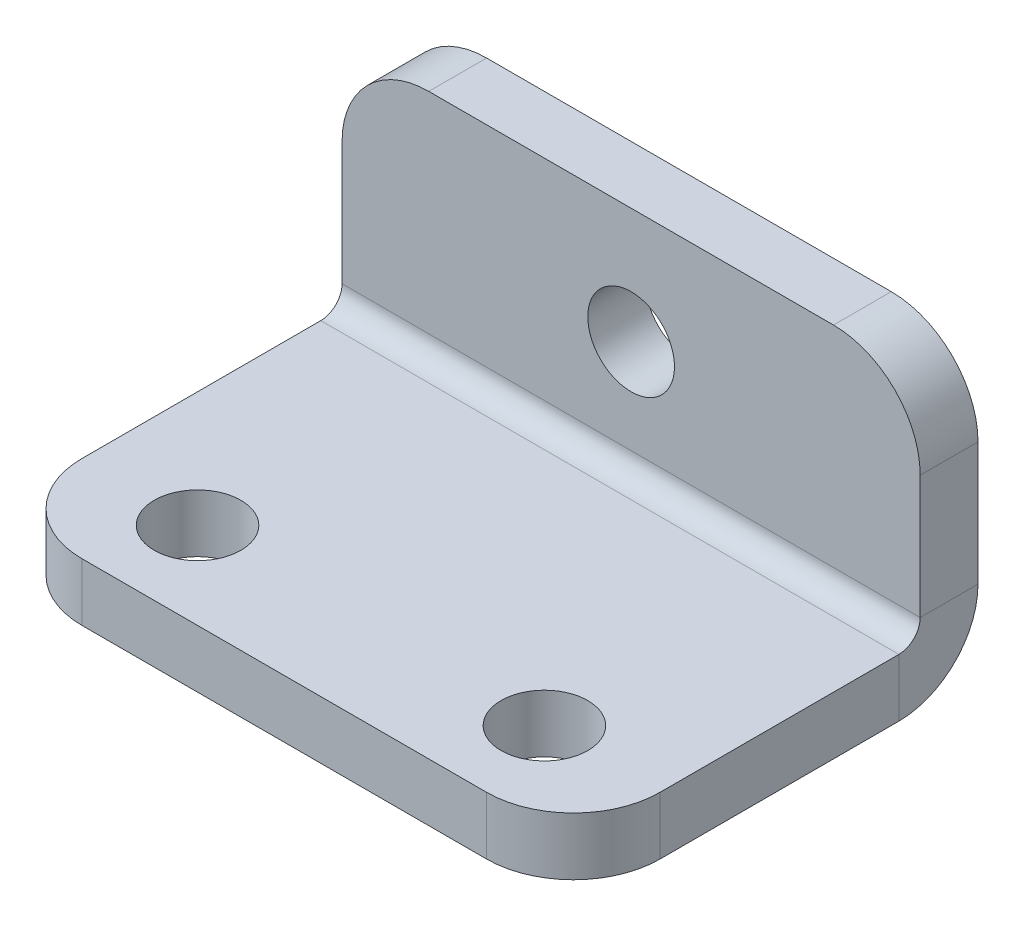
ISO-10303-21;
HEADER;
FILE_DESCRIPTION(('STEP AP214'),'2;1');
FILE_NAME('part.step','',(''),(''),'','','');
FILE_SCHEMA(('AUTOMOTIVE_DESIGN { 1 0 10303 214 1 1 1 1 }'));
ENDSEC;
DATA;
#1=APPLICATION_CONTEXT('core data for automotive mechanical design processes');
#2=APPLICATION_PROTOCOL_DEFINITION('international standard','automotive_design',2000,#1);
#3=PRODUCT_CONTEXT('',#1,'mechanical');
#4=PRODUCT('Part','Part','',(#3));
#5=PRODUCT_RELATED_PRODUCT_CATEGORY('part','',(#4));
#6=PRODUCT_DEFINITION_FORMATION('','',#4);
#7=PRODUCT_DEFINITION_CONTEXT('part definition',#1,'design');
#8=PRODUCT_DEFINITION('design','',#6,#7);
#9=PRODUCT_DEFINITION_SHAPE('','',#8);
#10=(LENGTH_UNIT() NAMED_UNIT(*) SI_UNIT(.MILLI.,.METRE.));
#11=(NAMED_UNIT(*) PLANE_ANGLE_UNIT() SI_UNIT($,.RADIAN.));
#12=(NAMED_UNIT(*) SI_UNIT($,.STERADIAN.) SOLID_ANGLE_UNIT());
#13=UNCERTAINTY_MEASURE_WITH_UNIT(LENGTH_MEASURE(1.E-05),#10,'distance_accuracy_value','');
#14=(GEOMETRIC_REPRESENTATION_CONTEXT(3) GLOBAL_UNCERTAINTY_ASSIGNED_CONTEXT((#13)) GLOBAL_UNIT_ASSIGNED_CONTEXT((#10,
#11,#12)) REPRESENTATION_CONTEXT('',''));
#15=CARTESIAN_POINT('',(0.,0.,0.));
#16=DIRECTION('',(0.,0.,1.));
#17=DIRECTION('',(1.,0.,0.));
#18=AXIS2_PLACEMENT_3D('',#15,#16,#17);
#19=CARTESIAN_POINT('',(10.,0.7366,-12.));
#20=DIRECTION('',(1.,0.,0.));
#21=DIRECTION('',(0.,0.,-1.));
#22=AXIS2_PLACEMENT_3D('',#19,#20,#21);
#23=PLANE('',#22);
#24=DIRECTION('',(0.,0.,-1.));
#25=VECTOR('',#24,1.);
#26=CARTESIAN_POINT('',(10.,0.7366,-12.));
#27=LINE('',#26,#25);
#28=CARTESIAN_POINT('',(10.,0.7366,-12.));
#29=VERTEX_POINT('',#28);
#30=CARTESIAN_POINT('',(10.,0.7366,-14.));
#31=VERTEX_POINT('',#30);
#32=EDGE_CURVE('E126',#29,#31,#27,.T.);
#33=ORIENTED_EDGE('',*,*,#32,.F.);
#34=CARTESIAN_POINT('',(10.,0.7366,-11.2634));
#35=DIRECTION('',(-1.,0.,0.));
#36=DIRECTION('',(0.,0.,1.));
#37=AXIS2_PLACEMENT_3D('',#34,#35,#36);
#38=CIRCLE('',#37,0.7366);
#39=CARTESIAN_POINT('',(10.,0.,-11.2634));
#40=VERTEX_POINT('',#39);
#41=EDGE_CURVE('E130',#40,#29,#38,.F.);
#42=ORIENTED_EDGE('',*,*,#41,.F.);
#43=DIRECTION('',(0.,1.,0.));
#44=VECTOR('',#43,1.);
#45=CARTESIAN_POINT('',(10.,-2.,-11.2634));
#46=LINE('',#45,#44);
#47=CARTESIAN_POINT('',(10.,-2.,-11.2634));
#48=VERTEX_POINT('',#47);
#49=EDGE_CURVE('E138',#48,#40,#46,.T.);
#50=ORIENTED_EDGE('',*,*,#49,.F.);
#51=CARTESIAN_POINT('',(10.,0.7366,-11.2634));
#52=DIRECTION('',(1.,0.,0.));
#53=DIRECTION('',(0.,0.,-1.));
#54=AXIS2_PLACEMENT_3D('',#51,#52,#53);
#55=CIRCLE('',#54,2.7366);
#56=EDGE_CURVE('E132',#48,#31,#55,.T.);
#57=ORIENTED_EDGE('',*,*,#56,.T.);
#58=EDGE_LOOP('',(#33,#42,#50,#57));
#59=FACE_BOUND('',#58,.T.);
#60=ADVANCED_FACE('F34',(#59),#23,.T.);
#61=CARTESIAN_POINT('',(10.,-2.,-11.2634));
#62=DIRECTION('',(1.,0.,0.));
#63=DIRECTION('',(0.,0.,-1.));
#64=AXIS2_PLACEMENT_3D('',#61,#62,#63);
#65=PLANE('',#64);
#66=DIRECTION('',(0.,1.,0.));
#67=VECTOR('',#66,1.);
#68=CARTESIAN_POINT('',(10.,0.,-14.));
#69=LINE('',#68,#67);
#70=CARTESIAN_POINT('',(10.,5.,-14.));
#71=VERTEX_POINT('',#70);
#72=EDGE_CURVE('E159',#31,#71,#69,.T.);
#73=ORIENTED_EDGE('',*,*,#72,.T.);
#74=DIRECTION('',(0.,0.,-1.));
#75=VECTOR('',#74,1.);
#76=CARTESIAN_POINT('',(10.,5.,-11.2634));
#77=LINE('',#76,#75);
#78=CARTESIAN_POINT('',(10.,5.,-12.));
#79=VERTEX_POINT('',#78);
#80=EDGE_CURVE('E11',#71,#79,#77,.F.);
#81=ORIENTED_EDGE('',*,*,#80,.T.);
#82=DIRECTION('',(0.,1.,0.));
#83=VECTOR('',#82,1.);
#84=CARTESIAN_POINT('',(10.,0.,-12.));
#85=LINE('',#84,#83);
#86=EDGE_CURVE('E147',#29,#79,#85,.T.);
#87=ORIENTED_EDGE('',*,*,#86,.F.);
#88=ORIENTED_EDGE('',*,*,#32,.T.);
#89=EDGE_LOOP('',(#73,#81,#87,#88));
#90=FACE_BOUND('',#89,.T.);
#91=ADVANCED_FACE('F157',(#90),#65,.T.);
#92=CARTESIAN_POINT('',(-10.,0.,-11.2634));
#93=DIRECTION('',(-1.,0.,0.));
#94=DIRECTION('',(0.,0.,1.));
#95=AXIS2_PLACEMENT_3D('',#92,#93,#94);
#96=PLANE('',#95);
#97=DIRECTION('',(0.,-1.,0.));
#98=VECTOR('',#97,1.);
#99=CARTESIAN_POINT('',(-10.,0.,-11.2634));
#100=LINE('',#99,#98);
#101=CARTESIAN_POINT('',(-10.,0.,-11.2634));
#102=VERTEX_POINT('',#101);
#103=CARTESIAN_POINT('',(-10.,-2.,-11.2634));
#104=VERTEX_POINT('',#103);
#105=EDGE_CURVE('E203',#102,#104,#100,.T.);
#106=ORIENTED_EDGE('',*,*,#105,.F.);
#107=CARTESIAN_POINT('',(-10.,0.7366,-11.2634));
#108=DIRECTION('',(-1.,0.,0.));
#109=DIRECTION('',(0.,0.,1.));
#110=AXIS2_PLACEMENT_3D('',#107,#108,#109);
#111=CIRCLE('',#110,0.7366);
#112=CARTESIAN_POINT('',(-10.,0.7366,-12.));
#113=VERTEX_POINT('',#112);
#114=EDGE_CURVE('E178',#102,#113,#111,.F.);
#115=ORIENTED_EDGE('',*,*,#114,.T.);
#116=DIRECTION('',(0.,0.,1.));
#117=VECTOR('',#116,1.);
#118=CARTESIAN_POINT('',(-10.,0.7366,-14.));
#119=LINE('',#118,#117);
#120=CARTESIAN_POINT('',(-10.,0.7366,-14.));
#121=VERTEX_POINT('',#120);
#122=EDGE_CURVE('E201',#121,#113,#119,.T.);
#123=ORIENTED_EDGE('',*,*,#122,.F.);
#124=CARTESIAN_POINT('',(-10.,0.7366,-11.2634));
#125=DIRECTION('',(1.,0.,0.));
#126=DIRECTION('',(0.,0.,-1.));
#127=AXIS2_PLACEMENT_3D('',#124,#125,#126);
#128=CIRCLE('',#127,2.7366);
#129=EDGE_CURVE('E184',#104,#121,#128,.T.);
#130=ORIENTED_EDGE('',*,*,#129,.F.);
#131=EDGE_LOOP('',(#106,#115,#123,#130));
#132=FACE_BOUND('',#131,.T.);
#133=ADVANCED_FACE('F269',(#132),#96,.T.);
#134=CARTESIAN_POINT('',(-10.,0.7366,-14.));
#135=DIRECTION('',(-1.,0.,0.));
#136=DIRECTION('',(0.,0.,1.));
#137=AXIS2_PLACEMENT_3D('',#134,#135,#136);
#138=PLANE('',#137);
#139=DIRECTION('',(0.,0.,-1.));
#140=VECTOR('',#139,1.);
#141=CARTESIAN_POINT('',(-10.,-2.,0.));
#142=LINE('',#141,#140);
#143=CARTESIAN_POINT('',(-10.,-2.,-3.));
#144=VERTEX_POINT('',#143);
#145=EDGE_CURVE('E182',#144,#104,#142,.T.);
#146=ORIENTED_EDGE('',*,*,#145,.F.);
#147=DIRECTION('',(0.,1.,0.));
#148=VECTOR('',#147,1.);
#149=CARTESIAN_POINT('',(-10.,0.7366,-3.));
#150=LINE('',#149,#148);
#151=CARTESIAN_POINT('',(-10.,0.,-3.));
#152=VERTEX_POINT('',#151);
#153=EDGE_CURVE('E223',#144,#152,#150,.T.);
#154=ORIENTED_EDGE('',*,*,#153,.T.);
#155=DIRECTION('',(0.,0.,-1.));
#156=VECTOR('',#155,1.);
#157=CARTESIAN_POINT('',(-10.,0.,0.));
#158=LINE('',#157,#156);
#159=EDGE_CURVE('E180',#152,#102,#158,.T.);
#160=ORIENTED_EDGE('',*,*,#159,.T.);
#161=ORIENTED_EDGE('',*,*,#105,.T.);
#162=EDGE_LOOP('',(#146,#154,#160,#161));
#163=FACE_BOUND('',#162,.T.);
#164=ADVANCED_FACE('F275',(#163),#138,.T.);
#165=CARTESIAN_POINT('',(10.,0.,-14.));
#166=DIRECTION('',(0.,0.,1.));
#167=DIRECTION('',(1.,0.,0.));
#168=AXIS2_PLACEMENT_3D('',#165,#166,#167);
#169=PLANE('',#168);
#170=CARTESIAN_POINT('',(0.,4.,-14.));
#171=DIRECTION('',(0.,0.,1.));
#172=DIRECTION('',(1.,0.,0.));
#173=AXIS2_PLACEMENT_3D('',#170,#171,#172);
#174=CIRCLE('',#173,1.5);
#175=CARTESIAN_POINT('',(1.5,4.,-14.));
#176=VERTEX_POINT('',#175);
#177=EDGE_CURVE('E348',#176,#176,#174,.T.);
#178=ORIENTED_EDGE('',*,*,#177,.T.);
#179=EDGE_LOOP('',(#178));
#180=FACE_BOUND('',#179,.T.);
#181=DIRECTION('',(0.,1.,0.));
#182=VECTOR('',#181,1.);
#183=CARTESIAN_POINT('',(-10.,0.,-14.));
#184=LINE('',#183,#182);
#185=CARTESIAN_POINT('',(-10.,5.,-14.));
#186=VERTEX_POINT('',#185);
#187=EDGE_CURVE('E173',#121,#186,#184,.T.);
#188=ORIENTED_EDGE('',*,*,#187,.T.);
#189=CARTESIAN_POINT('',(-7.,5.,-14.));
#190=DIRECTION('',(0.,0.,1.));
#191=DIRECTION('',(1.,0.,0.));
#192=AXIS2_PLACEMENT_3D('',#189,#190,#191);
#193=CIRCLE('',#192,3.);
#194=CARTESIAN_POINT('',(-7.,8.,-14.));
#195=VERTEX_POINT('',#194);
#196=EDGE_CURVE('E212',#186,#195,#193,.F.);
#197=ORIENTED_EDGE('',*,*,#196,.T.);
#198=DIRECTION('',(-1.,0.,0.));
#199=VECTOR('',#198,1.);
#200=CARTESIAN_POINT('',(10.,8.,-14.));
#201=LINE('',#200,#199);
#202=CARTESIAN_POINT('',(7.,8.,-14.));
#203=VERTEX_POINT('',#202);
#204=EDGE_CURVE('E198',#203,#195,#201,.T.);
#205=ORIENTED_EDGE('',*,*,#204,.F.);
#206=CARTESIAN_POINT('',(7.,5.,-14.));
#207=DIRECTION('',(0.,0.,1.));
#208=DIRECTION('',(1.,0.,0.));
#209=AXIS2_PLACEMENT_3D('',#206,#207,#208);
#210=CIRCLE('',#209,3.);
#211=EDGE_CURVE('E210',#203,#71,#210,.F.);
#212=ORIENTED_EDGE('',*,*,#211,.T.);
#213=ORIENTED_EDGE('',*,*,#72,.F.);
#214=DIRECTION('',(-1.,0.,0.));
#215=VECTOR('',#214,1.);
#216=CARTESIAN_POINT('',(10.,0.7366,-14.));
#217=LINE('',#216,#215);
#218=EDGE_CURVE('E172',#31,#121,#217,.T.);
#219=ORIENTED_EDGE('',*,*,#218,.T.);
#220=EDGE_LOOP('',(#188,#197,#205,#212,#213,#219));
#221=FACE_BOUND('',#220,.T.);
#222=ADVANCED_FACE('F273',(#180,#221),#169,.F.);
#223=CARTESIAN_POINT('',(10.,8.,-12.));
#224=DIRECTION('',(0.,1.,0.));
#225=DIRECTION('',(0.,0.,1.));
#226=AXIS2_PLACEMENT_3D('',#223,#224,#225);
#227=PLANE('',#226);
#228=ORIENTED_EDGE('',*,*,#204,.T.);
#229=DIRECTION('',(0.,0.,-1.));
#230=VECTOR('',#229,1.);
#231=CARTESIAN_POINT('',(-7.,8.,-12.));
#232=LINE('',#231,#230);
#233=CARTESIAN_POINT('',(-7.,8.,-12.));
#234=VERTEX_POINT('',#233);
#235=EDGE_CURVE('E217',#195,#234,#232,.F.);
#236=ORIENTED_EDGE('',*,*,#235,.T.);
#237=DIRECTION('',(-1.,0.,0.));
#238=VECTOR('',#237,1.);
#239=CARTESIAN_POINT('',(10.,8.,-12.));
#240=LINE('',#239,#238);
#241=CARTESIAN_POINT('',(7.,8.,-12.));
#242=VERTEX_POINT('',#241);
#243=EDGE_CURVE('E154',#242,#234,#240,.T.);
#244=ORIENTED_EDGE('',*,*,#243,.F.);
#245=DIRECTION('',(0.,0.,-1.));
#246=VECTOR('',#245,1.);
#247=CARTESIAN_POINT('',(7.,8.,-12.));
#248=LINE('',#247,#246);
#249=EDGE_CURVE('E214',#242,#203,#248,.T.);
#250=ORIENTED_EDGE('',*,*,#249,.T.);
#251=EDGE_LOOP('',(#228,#236,#244,#250));
#252=FACE_BOUND('',#251,.T.);
#253=ADVANCED_FACE('F257',(#252),#227,.T.);
#254=CARTESIAN_POINT('',(10.,0.,-12.));
#255=DIRECTION('',(0.,0.,1.));
#256=DIRECTION('',(1.,0.,0.));
#257=AXIS2_PLACEMENT_3D('',#254,#255,#256);
#258=PLANE('',#257);
#259=CARTESIAN_POINT('',(0.,4.,-12.));
#260=DIRECTION('',(0.,0.,1.));
#261=DIRECTION('',(1.,0.,0.));
#262=AXIS2_PLACEMENT_3D('',#259,#260,#261);
#263=CIRCLE('',#262,1.5);
#264=CARTESIAN_POINT('',(1.5,4.,-12.));
#265=VERTEX_POINT('',#264);
#266=EDGE_CURVE('E346',#265,#265,#263,.T.);
#267=ORIENTED_EDGE('',*,*,#266,.F.);
#268=EDGE_LOOP('',(#267));
#269=FACE_BOUND('',#268,.T.);
#270=ORIENTED_EDGE('',*,*,#243,.T.);
#271=CARTESIAN_POINT('',(-7.,5.,-12.));
#272=DIRECTION('',(0.,0.,1.));
#273=DIRECTION('',(1.,0.,0.));
#274=AXIS2_PLACEMENT_3D('',#271,#272,#273);
#275=CIRCLE('',#274,3.);
#276=CARTESIAN_POINT('',(-10.,5.,-12.));
#277=VERTEX_POINT('',#276);
#278=EDGE_CURVE('E221',#234,#277,#275,.T.);
#279=ORIENTED_EDGE('',*,*,#278,.T.);
#280=DIRECTION('',(0.,1.,0.));
#281=VECTOR('',#280,1.);
#282=CARTESIAN_POINT('',(-10.,0.,-12.));
#283=LINE('',#282,#281);
#284=EDGE_CURVE('E150',#113,#277,#283,.T.);
#285=ORIENTED_EDGE('',*,*,#284,.F.);
#286=DIRECTION('',(-1.,0.,0.));
#287=VECTOR('',#286,1.);
#288=CARTESIAN_POINT('',(10.,0.7366,-12.));
#289=LINE('',#288,#287);
#290=EDGE_CURVE('E144',#29,#113,#289,.T.);
#291=ORIENTED_EDGE('',*,*,#290,.F.);
#292=ORIENTED_EDGE('',*,*,#86,.T.);
#293=CARTESIAN_POINT('',(7.,5.,-12.));
#294=DIRECTION('',(0.,0.,1.));
#295=DIRECTION('',(1.,0.,0.));
#296=AXIS2_PLACEMENT_3D('',#293,#294,#295);
#297=CIRCLE('',#296,3.);
#298=EDGE_CURVE('E219',#79,#242,#297,.T.);
#299=ORIENTED_EDGE('',*,*,#298,.T.);
#300=EDGE_LOOP('',(#270,#279,#285,#291,#292,#299));
#301=FACE_BOUND('',#300,.T.);
#302=ADVANCED_FACE('F146',(#269,#301),#258,.T.);
#303=CARTESIAN_POINT('',(10.,0.7366,-11.2634));
#304=DIRECTION('',(-1.,0.,0.));
#305=DIRECTION('',(0.,0.,1.));
#306=AXIS2_PLACEMENT_3D('',#303,#304,#305);
#307=CYLINDRICAL_SURFACE('',#306,0.7366);
#308=ORIENTED_EDGE('',*,*,#114,.F.);
#309=DIRECTION('',(-1.,0.,0.));
#310=VECTOR('',#309,1.);
#311=CARTESIAN_POINT('',(10.,0.,-11.2634));
#312=LINE('',#311,#310);
#313=EDGE_CURVE('E155',#40,#102,#312,.T.);
#314=ORIENTED_EDGE('',*,*,#313,.F.);
#315=ORIENTED_EDGE('',*,*,#41,.T.);
#316=ORIENTED_EDGE('',*,*,#290,.T.);
#317=EDGE_LOOP('',(#308,#314,#315,#316));
#318=FACE_BOUND('',#317,.T.);
#319=ADVANCED_FACE('F162',(#318),#307,.F.);
#320=CARTESIAN_POINT('',(10.,0.,0.));
#321=DIRECTION('',(0.,1.,0.));
#322=DIRECTION('',(0.,0.,1.));
#323=AXIS2_PLACEMENT_3D('',#320,#321,#322);
#324=PLANE('',#323);
#325=CARTESIAN_POINT('',(6.,0.,-3.));
#326=DIRECTION('',(0.,1.,0.));
#327=DIRECTION('',(0.,0.,1.));
#328=AXIS2_PLACEMENT_3D('',#325,#326,#327);
#329=CIRCLE('',#328,1.5);
#330=CARTESIAN_POINT('',(6.,0.,-1.5));
#331=VERTEX_POINT('',#330);
#332=EDGE_CURVE('E247',#331,#331,#329,.T.);
#333=ORIENTED_EDGE('',*,*,#332,.F.);
#334=EDGE_LOOP('',(#333));
#335=FACE_BOUND('',#334,.T.);
#336=CARTESIAN_POINT('',(-6.,0.,-3.));
#337=DIRECTION('',(0.,1.,0.));
#338=DIRECTION('',(0.,0.,1.));
#339=AXIS2_PLACEMENT_3D('',#336,#337,#338);
#340=CIRCLE('',#339,1.5);
#341=CARTESIAN_POINT('',(-6.,0.,-1.5));
#342=VERTEX_POINT('',#341);
#343=EDGE_CURVE('E239',#342,#342,#340,.T.);
#344=ORIENTED_EDGE('',*,*,#343,.F.);
#345=EDGE_LOOP('',(#344));
#346=FACE_BOUND('',#345,.T.);
#347=ORIENTED_EDGE('',*,*,#159,.F.);
#348=CARTESIAN_POINT('',(-7.,0.,-3.));
#349=DIRECTION('',(0.,1.,0.));
#350=DIRECTION('',(0.,0.,1.));
#351=AXIS2_PLACEMENT_3D('',#348,#349,#350);
#352=CIRCLE('',#351,3.);
#353=CARTESIAN_POINT('',(-7.,0.,0.));
#354=VERTEX_POINT('',#353);
#355=EDGE_CURVE('E228',#152,#354,#352,.T.);
#356=ORIENTED_EDGE('',*,*,#355,.T.);
#357=DIRECTION('',(-1.,0.,0.));
#358=VECTOR('',#357,1.);
#359=CARTESIAN_POINT('',(10.,0.,0.));
#360=LINE('',#359,#358);
#361=CARTESIAN_POINT('',(7.,0.,0.));
#362=VERTEX_POINT('',#361);
#363=EDGE_CURVE('E194',#362,#354,#360,.T.);
#364=ORIENTED_EDGE('',*,*,#363,.F.);
#365=CARTESIAN_POINT('',(7.,0.,-3.));
#366=DIRECTION('',(0.,1.,0.));
#367=DIRECTION('',(0.,0.,1.));
#368=AXIS2_PLACEMENT_3D('',#365,#366,#367);
#369=CIRCLE('',#368,3.);
#370=CARTESIAN_POINT('',(10.,0.,-3.));
#371=VERTEX_POINT('',#370);
#372=EDGE_CURVE('E226',#362,#371,#369,.T.);
#373=ORIENTED_EDGE('',*,*,#372,.T.);
#374=DIRECTION('',(0.,0.,-1.));
#375=VECTOR('',#374,1.);
#376=CARTESIAN_POINT('',(10.,0.,0.));
#377=LINE('',#376,#375);
#378=EDGE_CURVE('E164',#371,#40,#377,.T.);
#379=ORIENTED_EDGE('',*,*,#378,.T.);
#380=ORIENTED_EDGE('',*,*,#313,.T.);
#381=EDGE_LOOP('',(#347,#356,#364,#373,#379,#380));
#382=FACE_BOUND('',#381,.T.);
#383=ADVANCED_FACE('F315',(#335,#346,#382),#324,.T.);
#384=CARTESIAN_POINT('',(10.,-2.,0.));
#385=DIRECTION('',(0.,0.,1.));
#386=DIRECTION('',(1.,0.,0.));
#387=AXIS2_PLACEMENT_3D('',#384,#385,#386);
#388=PLANE('',#387);
#389=ORIENTED_EDGE('',*,*,#363,.T.);
#390=DIRECTION('',(0.,1.,0.));
#391=VECTOR('',#390,1.);
#392=CARTESIAN_POINT('',(-7.,-2.,0.));
#393=LINE('',#392,#391);
#394=CARTESIAN_POINT('',(-7.,-2.,0.));
#395=VERTEX_POINT('',#394);
#396=EDGE_CURVE('E58',#354,#395,#393,.F.);
#397=ORIENTED_EDGE('',*,*,#396,.T.);
#398=DIRECTION('',(-1.,0.,0.));
#399=VECTOR('',#398,1.);
#400=CARTESIAN_POINT('',(10.,-2.,0.));
#401=LINE('',#400,#399);
#402=CARTESIAN_POINT('',(7.,-2.,0.));
#403=VERTEX_POINT('',#402);
#404=EDGE_CURVE('E192',#403,#395,#401,.T.);
#405=ORIENTED_EDGE('',*,*,#404,.F.);
#406=DIRECTION('',(0.,1.,0.));
#407=VECTOR('',#406,1.);
#408=CARTESIAN_POINT('',(7.,0.,0.));
#409=LINE('',#408,#407);
#410=EDGE_CURVE('E230',#403,#362,#409,.T.);
#411=ORIENTED_EDGE('',*,*,#410,.T.);
#412=EDGE_LOOP('',(#389,#397,#405,#411));
#413=FACE_BOUND('',#412,.T.);
#414=ADVANCED_FACE('F311',(#413),#388,.T.);
#415=CARTESIAN_POINT('',(10.,-2.,0.));
#416=DIRECTION('',(0.,1.,0.));
#417=DIRECTION('',(0.,0.,1.));
#418=AXIS2_PLACEMENT_3D('',#415,#416,#417);
#419=PLANE('',#418);
#420=CARTESIAN_POINT('',(6.,-2.,-3.));
#421=DIRECTION('',(0.,1.,0.));
#422=DIRECTION('',(0.,0.,1.));
#423=AXIS2_PLACEMENT_3D('',#420,#421,#422);
#424=CIRCLE('',#423,1.5);
#425=CARTESIAN_POINT('',(6.,-2.,-1.5));
#426=VERTEX_POINT('',#425);
#427=EDGE_CURVE('E38',#426,#426,#424,.T.);
#428=ORIENTED_EDGE('',*,*,#427,.T.);
#429=EDGE_LOOP('',(#428));
#430=FACE_BOUND('',#429,.T.);
#431=CARTESIAN_POINT('',(-6.,-2.,-3.));
#432=DIRECTION('',(0.,1.,0.));
#433=DIRECTION('',(0.,0.,1.));
#434=AXIS2_PLACEMENT_3D('',#431,#432,#433);
#435=CIRCLE('',#434,1.5);
#436=CARTESIAN_POINT('',(-6.,-2.,-1.5));
#437=VERTEX_POINT('',#436);
#438=EDGE_CURVE('E176',#437,#437,#435,.T.);
#439=ORIENTED_EDGE('',*,*,#438,.T.);
#440=EDGE_LOOP('',(#439));
#441=FACE_BOUND('',#440,.T.);
#442=ORIENTED_EDGE('',*,*,#404,.T.);
#443=CARTESIAN_POINT('',(-7.,-2.,-3.));
#444=DIRECTION('',(0.,1.,0.));
#445=DIRECTION('',(0.,0.,1.));
#446=AXIS2_PLACEMENT_3D('',#443,#444,#445);
#447=CIRCLE('',#446,3.);
#448=EDGE_CURVE('E236',#395,#144,#447,.F.);
#449=ORIENTED_EDGE('',*,*,#448,.T.);
#450=ORIENTED_EDGE('',*,*,#145,.T.);
#451=DIRECTION('',(-1.,0.,0.));
#452=VECTOR('',#451,1.);
#453=CARTESIAN_POINT('',(10.,-2.,-11.2634));
#454=LINE('',#453,#452);
#455=EDGE_CURVE('E189',#48,#104,#454,.T.);
#456=ORIENTED_EDGE('',*,*,#455,.F.);
#457=DIRECTION('',(0.,0.,-1.));
#458=VECTOR('',#457,1.);
#459=CARTESIAN_POINT('',(10.,-2.,0.));
#460=LINE('',#459,#458);
#461=CARTESIAN_POINT('',(10.,-2.,-3.));
#462=VERTEX_POINT('',#461);
#463=EDGE_CURVE('E166',#462,#48,#460,.T.);
#464=ORIENTED_EDGE('',*,*,#463,.F.);
#465=CARTESIAN_POINT('',(7.,-2.,-3.));
#466=DIRECTION('',(0.,1.,0.));
#467=DIRECTION('',(0.,0.,1.));
#468=AXIS2_PLACEMENT_3D('',#465,#466,#467);
#469=CIRCLE('',#468,3.);
#470=EDGE_CURVE('E234',#462,#403,#469,.F.);
#471=ORIENTED_EDGE('',*,*,#470,.T.);
#472=EDGE_LOOP('',(#442,#449,#450,#456,#464,#471));
#473=FACE_BOUND('',#472,.T.);
#474=ADVANCED_FACE('F309',(#430,#441,#473),#419,.F.);
#475=CARTESIAN_POINT('',(10.,0.7366,-11.2634));
#476=DIRECTION('',(-1.,0.,0.));
#477=DIRECTION('',(0.,0.,1.));
#478=AXIS2_PLACEMENT_3D('',#475,#476,#477);
#479=CYLINDRICAL_SURFACE('',#478,2.7366);
#480=ORIENTED_EDGE('',*,*,#129,.T.);
#481=ORIENTED_EDGE('',*,*,#218,.F.);
#482=ORIENTED_EDGE('',*,*,#56,.F.);
#483=ORIENTED_EDGE('',*,*,#455,.T.);
#484=EDGE_LOOP('',(#480,#481,#482,#483));
#485=FACE_BOUND('',#484,.T.);
#486=ADVANCED_FACE('F271',(#485),#479,.T.);
#487=CARTESIAN_POINT('',(10.,0.7366,-11.2634));
#488=DIRECTION('',(-1.,0.,0.));
#489=DIRECTION('',(0.,0.,1.));
#490=AXIS2_PLACEMENT_3D('',#487,#488,#489);
#491=PLANE('',#490);
#492=ORIENTED_EDGE('',*,*,#378,.F.);
#493=DIRECTION('',(0.,1.,0.));
#494=VECTOR('',#493,1.);
#495=CARTESIAN_POINT('',(10.,-2.,-3.));
#496=LINE('',#495,#494);
#497=EDGE_CURVE('E43',#371,#462,#496,.F.);
#498=ORIENTED_EDGE('',*,*,#497,.T.);
#499=ORIENTED_EDGE('',*,*,#463,.T.);
#500=ORIENTED_EDGE('',*,*,#49,.T.);
#501=EDGE_LOOP('',(#492,#498,#499,#500));
#502=FACE_BOUND('',#501,.T.);
#503=ADVANCED_FACE('F318',(#502),#491,.F.);
#504=CARTESIAN_POINT('',(-10.,0.7366,-11.2634));
#505=DIRECTION('',(-1.,0.,0.));
#506=DIRECTION('',(0.,0.,1.));
#507=AXIS2_PLACEMENT_3D('',#504,#505,#506);
#508=PLANE('',#507);
#509=ORIENTED_EDGE('',*,*,#284,.T.);
#510=DIRECTION('',(0.,0.,-1.));
#511=VECTOR('',#510,1.);
#512=CARTESIAN_POINT('',(-10.,5.,-11.2634));
#513=LINE('',#512,#511);
#514=EDGE_CURVE('E137',#277,#186,#513,.T.);
#515=ORIENTED_EDGE('',*,*,#514,.T.);
#516=ORIENTED_EDGE('',*,*,#187,.F.);
#517=ORIENTED_EDGE('',*,*,#122,.T.);
#518=EDGE_LOOP('',(#509,#515,#516,#517));
#519=FACE_BOUND('',#518,.T.);
#520=ADVANCED_FACE('F264',(#519),#508,.T.);
#521=CARTESIAN_POINT('',(-7.,5.,-11.2634));
#522=DIRECTION('',(0.,0.,-1.));
#523=DIRECTION('',(-1.,0.,0.));
#524=AXIS2_PLACEMENT_3D('',#521,#522,#523);
#525=CYLINDRICAL_SURFACE('',#524,3.);
#526=ORIENTED_EDGE('',*,*,#278,.F.);
#527=ORIENTED_EDGE('',*,*,#235,.F.);
#528=ORIENTED_EDGE('',*,*,#196,.F.);
#529=ORIENTED_EDGE('',*,*,#514,.F.);
#530=EDGE_LOOP('',(#526,#527,#528,#529));
#531=FACE_BOUND('',#530,.T.);
#532=ADVANCED_FACE('F261',(#531),#525,.T.);
#533=CARTESIAN_POINT('',(-7.,0.7366,-3.));
#534=DIRECTION('',(0.,1.,0.));
#535=DIRECTION('',(0.,0.,1.));
#536=AXIS2_PLACEMENT_3D('',#533,#534,#535);
#537=CYLINDRICAL_SURFACE('',#536,3.);
#538=ORIENTED_EDGE('',*,*,#448,.F.);
#539=ORIENTED_EDGE('',*,*,#396,.F.);
#540=ORIENTED_EDGE('',*,*,#355,.F.);
#541=ORIENTED_EDGE('',*,*,#153,.F.);
#542=EDGE_LOOP('',(#538,#539,#540,#541));
#543=FACE_BOUND('',#542,.T.);
#544=ADVANCED_FACE('F296',(#543),#537,.T.);
#545=CARTESIAN_POINT('',(7.,-2.,-3.));
#546=DIRECTION('',(0.,-1.,0.));
#547=DIRECTION('',(0.,0.,-1.));
#548=AXIS2_PLACEMENT_3D('',#545,#546,#547);
#549=CYLINDRICAL_SURFACE('',#548,3.);
#550=ORIENTED_EDGE('',*,*,#470,.F.);
#551=ORIENTED_EDGE('',*,*,#497,.F.);
#552=ORIENTED_EDGE('',*,*,#372,.F.);
#553=ORIENTED_EDGE('',*,*,#410,.F.);
#554=EDGE_LOOP('',(#550,#551,#552,#553));
#555=FACE_BOUND('',#554,.T.);
#556=ADVANCED_FACE('F298',(#555),#549,.T.);
#557=CARTESIAN_POINT('',(7.,5.,-12.));
#558=DIRECTION('',(0.,0.,-1.));
#559=DIRECTION('',(-1.,0.,0.));
#560=AXIS2_PLACEMENT_3D('',#557,#558,#559);
#561=CYLINDRICAL_SURFACE('',#560,3.);
#562=ORIENTED_EDGE('',*,*,#298,.F.);
#563=ORIENTED_EDGE('',*,*,#80,.F.);
#564=ORIENTED_EDGE('',*,*,#211,.F.);
#565=ORIENTED_EDGE('',*,*,#249,.F.);
#566=EDGE_LOOP('',(#562,#563,#564,#565));
#567=FACE_BOUND('',#566,.T.);
#568=ADVANCED_FACE('F36',(#567),#561,.T.);
#569=CARTESIAN_POINT('',(-6.,-10.,-3.));
#570=DIRECTION('',(0.,1.,0.));
#571=DIRECTION('',(0.,0.,1.));
#572=AXIS2_PLACEMENT_3D('',#569,#570,#571);
#573=CYLINDRICAL_SURFACE('',#572,1.5);
#574=ORIENTED_EDGE('',*,*,#343,.T.);
#575=EDGE_LOOP('',(#574));
#576=FACE_BOUND('',#575,.T.);
#577=ORIENTED_EDGE('',*,*,#438,.F.);
#578=EDGE_LOOP('',(#577));
#579=FACE_BOUND('',#578,.T.);
#580=ADVANCED_FACE('F305',(#576,#579),#573,.F.);
#581=CARTESIAN_POINT('',(6.,-10.,-3.));
#582=DIRECTION('',(0.,1.,0.));
#583=DIRECTION('',(0.,0.,1.));
#584=AXIS2_PLACEMENT_3D('',#581,#582,#583);
#585=CYLINDRICAL_SURFACE('',#584,1.5);
#586=ORIENTED_EDGE('',*,*,#332,.T.);
#587=EDGE_LOOP('',(#586));
#588=FACE_BOUND('',#587,.T.);
#589=ORIENTED_EDGE('',*,*,#427,.F.);
#590=EDGE_LOOP('',(#589));
#591=FACE_BOUND('',#590,.T.);
#592=ADVANCED_FACE('F354',(#588,#591),#585,.F.);
#593=CARTESIAN_POINT('',(0.,4.,-22.));
#594=DIRECTION('',(0.,0.,1.));
#595=DIRECTION('',(1.,0.,0.));
#596=AXIS2_PLACEMENT_3D('',#593,#594,#595);
#597=CYLINDRICAL_SURFACE('',#596,1.5);
#598=ORIENTED_EDGE('',*,*,#266,.T.);
#599=EDGE_LOOP('',(#598));
#600=FACE_BOUND('',#599,.T.);
#601=ORIENTED_EDGE('',*,*,#177,.F.);
#602=EDGE_LOOP('',(#601));
#603=FACE_BOUND('',#602,.T.);
#604=ADVANCED_FACE('F358',(#600,#603),#597,.F.);
#605=CLOSED_SHELL('',(#60,#91,#133,#164,#222,#253,#302,#319,#383,#414,#474,#486,#503,#520,#532,
#544,#556,#568,#580,#592,#604));
#606=MANIFOLD_SOLID_BREP('B2',#605);
#607=ADVANCED_BREP_SHAPE_REPRESENTATION('',(#18,#606),#14);
#608=SHAPE_DEFINITION_REPRESENTATION(#9,#607);
ENDSEC;
END-ISO-10303-21;
